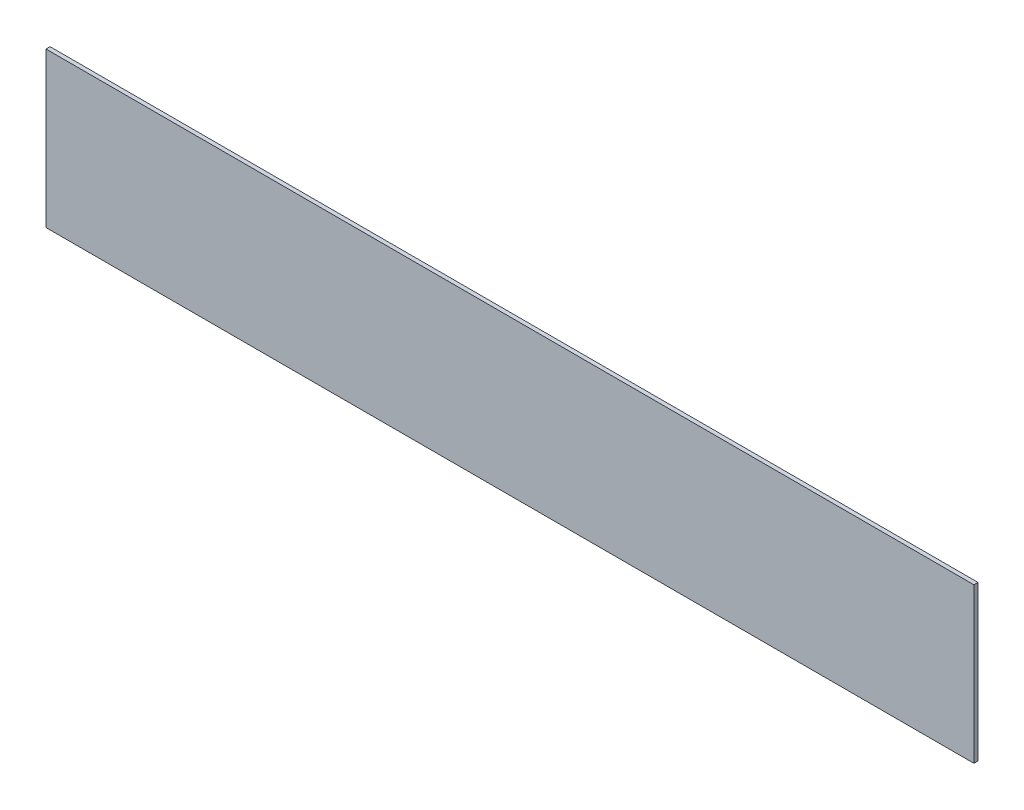
ISO-10303-21;
HEADER;
FILE_DESCRIPTION(('STEP AP214'),'2;1');
FILE_NAME('part.step','',(''),(''),'','','');
FILE_SCHEMA(('AUTOMOTIVE_DESIGN { 1 0 10303 214 1 1 1 1 }'));
ENDSEC;
DATA;
#1=APPLICATION_CONTEXT('core data for automotive mechanical design processes');
#2=APPLICATION_PROTOCOL_DEFINITION('international standard','automotive_design',2000,#1);
#3=PRODUCT_CONTEXT('',#1,'mechanical');
#4=PRODUCT('Part','Part','',(#3));
#5=PRODUCT_RELATED_PRODUCT_CATEGORY('part','',(#4));
#6=PRODUCT_DEFINITION_FORMATION('','',#4);
#7=PRODUCT_DEFINITION_CONTEXT('part definition',#1,'design');
#8=PRODUCT_DEFINITION('design','',#6,#7);
#9=PRODUCT_DEFINITION_SHAPE('','',#8);
#10=(LENGTH_UNIT() NAMED_UNIT(*) SI_UNIT(.MILLI.,.METRE.));
#11=(NAMED_UNIT(*) PLANE_ANGLE_UNIT() SI_UNIT($,.RADIAN.));
#12=(NAMED_UNIT(*) SI_UNIT($,.STERADIAN.) SOLID_ANGLE_UNIT());
#13=UNCERTAINTY_MEASURE_WITH_UNIT(LENGTH_MEASURE(1.E-05),#10,'distance_accuracy_value','');
#14=(GEOMETRIC_REPRESENTATION_CONTEXT(3) GLOBAL_UNCERTAINTY_ASSIGNED_CONTEXT((#13)) GLOBAL_UNIT_ASSIGNED_CONTEXT((#10,
#11,#12)) REPRESENTATION_CONTEXT('',''));
#15=CARTESIAN_POINT('',(0.,0.,0.));
#16=DIRECTION('',(0.,0.,1.));
#17=DIRECTION('',(1.,0.,0.));
#18=AXIS2_PLACEMENT_3D('',#15,#16,#17);
#19=CARTESIAN_POINT('',(228.6,38.1,2.));
#20=DIRECTION('',(-1.,0.,0.));
#21=DIRECTION('',(0.,0.,1.));
#22=AXIS2_PLACEMENT_3D('',#19,#20,#21);
#23=PLANE('',#22);
#24=DIRECTION('',(0.,1.,0.));
#25=VECTOR('',#24,1.);
#26=CARTESIAN_POINT('',(228.6,38.1,0.));
#27=LINE('',#26,#25);
#28=CARTESIAN_POINT('',(228.6,-38.1,0.));
#29=VERTEX_POINT('',#28);
#30=CARTESIAN_POINT('',(228.6,38.1,0.));
#31=VERTEX_POINT('',#30);
#32=EDGE_CURVE('E98',#29,#31,#27,.T.);
#33=ORIENTED_EDGE('',*,*,#32,.T.);
#34=DIRECTION('',(0.,0.,-1.));
#35=VECTOR('',#34,1.);
#36=CARTESIAN_POINT('',(228.6,38.1,2.));
#37=LINE('',#36,#35);
#38=CARTESIAN_POINT('',(228.6,38.1,2.));
#39=VERTEX_POINT('',#38);
#40=EDGE_CURVE('E11',#39,#31,#37,.T.);
#41=ORIENTED_EDGE('',*,*,#40,.F.);
#42=DIRECTION('',(0.,1.,0.));
#43=VECTOR('',#42,1.);
#44=CARTESIAN_POINT('',(228.6,38.1,2.));
#45=LINE('',#44,#43);
#46=CARTESIAN_POINT('',(228.6,-38.1,2.));
#47=VERTEX_POINT('',#46);
#48=EDGE_CURVE('E86',#47,#39,#45,.T.);
#49=ORIENTED_EDGE('',*,*,#48,.F.);
#50=DIRECTION('',(0.,0.,-1.));
#51=VECTOR('',#50,1.);
#52=CARTESIAN_POINT('',(228.6,-38.1,2.));
#53=LINE('',#52,#51);
#54=EDGE_CURVE('E94',#47,#29,#53,.T.);
#55=ORIENTED_EDGE('',*,*,#54,.T.);
#56=EDGE_LOOP('',(#33,#41,#49,#55));
#57=FACE_BOUND('',#56,.T.);
#58=ADVANCED_FACE('F35',(#57),#23,.F.);
#59=CARTESIAN_POINT('',(-228.6,38.1,2.));
#60=DIRECTION('',(0.,-1.,0.));
#61=DIRECTION('',(0.,0.,-1.));
#62=AXIS2_PLACEMENT_3D('',#59,#60,#61);
#63=PLANE('',#62);
#64=DIRECTION('',(-1.,0.,0.));
#65=VECTOR('',#64,1.);
#66=CARTESIAN_POINT('',(-228.6,38.1,0.));
#67=LINE('',#66,#65);
#68=CARTESIAN_POINT('',(-228.6,38.1,0.));
#69=VERTEX_POINT('',#68);
#70=EDGE_CURVE('E90',#31,#69,#67,.T.);
#71=ORIENTED_EDGE('',*,*,#70,.T.);
#72=DIRECTION('',(0.,0.,-1.));
#73=VECTOR('',#72,1.);
#74=CARTESIAN_POINT('',(-228.6,38.1,2.));
#75=LINE('',#74,#73);
#76=CARTESIAN_POINT('',(-228.6,38.1,2.));
#77=VERTEX_POINT('',#76);
#78=EDGE_CURVE('E43',#77,#69,#75,.T.);
#79=ORIENTED_EDGE('',*,*,#78,.F.);
#80=DIRECTION('',(-1.,0.,0.));
#81=VECTOR('',#80,1.);
#82=CARTESIAN_POINT('',(-228.6,38.1,2.));
#83=LINE('',#82,#81);
#84=EDGE_CURVE('E81',#39,#77,#83,.T.);
#85=ORIENTED_EDGE('',*,*,#84,.F.);
#86=ORIENTED_EDGE('',*,*,#40,.T.);
#87=EDGE_LOOP('',(#71,#79,#85,#86));
#88=FACE_BOUND('',#87,.T.);
#89=ADVANCED_FACE('F89',(#88),#63,.F.);
#90=CARTESIAN_POINT('',(-228.6,38.1,2.));
#91=DIRECTION('',(1.,0.,0.));
#92=DIRECTION('',(0.,1.,0.));
#93=AXIS2_PLACEMENT_3D('',#90,#91,#92);
#94=PLANE('',#93);
#95=DIRECTION('',(0.,-1.,0.));
#96=VECTOR('',#95,1.);
#97=CARTESIAN_POINT('',(-228.6,38.1,0.));
#98=LINE('',#97,#96);
#99=CARTESIAN_POINT('',(-228.6,-38.1,0.));
#100=VERTEX_POINT('',#99);
#101=EDGE_CURVE('E68',#69,#100,#98,.T.);
#102=ORIENTED_EDGE('',*,*,#101,.T.);
#103=DIRECTION('',(0.,0.,-1.));
#104=VECTOR('',#103,1.);
#105=CARTESIAN_POINT('',(-228.6,-38.1,2.));
#106=LINE('',#105,#104);
#107=CARTESIAN_POINT('',(-228.6,-38.1,2.));
#108=VERTEX_POINT('',#107);
#109=EDGE_CURVE('E91',#108,#100,#106,.T.);
#110=ORIENTED_EDGE('',*,*,#109,.F.);
#111=DIRECTION('',(0.,-1.,0.));
#112=VECTOR('',#111,1.);
#113=CARTESIAN_POINT('',(-228.6,38.1,2.));
#114=LINE('',#113,#112);
#115=EDGE_CURVE('E84',#77,#108,#114,.T.);
#116=ORIENTED_EDGE('',*,*,#115,.F.);
#117=ORIENTED_EDGE('',*,*,#78,.T.);
#118=EDGE_LOOP('',(#102,#110,#116,#117));
#119=FACE_BOUND('',#118,.T.);
#120=ADVANCED_FACE('F92',(#119),#94,.F.);
#121=CARTESIAN_POINT('',(-228.6,-38.1,2.));
#122=DIRECTION('',(0.,1.,0.));
#123=DIRECTION('',(0.,0.,1.));
#124=AXIS2_PLACEMENT_3D('',#121,#122,#123);
#125=PLANE('',#124);
#126=DIRECTION('',(1.,0.,0.));
#127=VECTOR('',#126,1.);
#128=CARTESIAN_POINT('',(-228.6,-38.1,0.));
#129=LINE('',#128,#127);
#130=EDGE_CURVE('E74',#100,#29,#129,.T.);
#131=ORIENTED_EDGE('',*,*,#130,.T.);
#132=ORIENTED_EDGE('',*,*,#54,.F.);
#133=DIRECTION('',(1.,0.,0.));
#134=VECTOR('',#133,1.);
#135=CARTESIAN_POINT('',(-228.6,-38.1,2.));
#136=LINE('',#135,#134);
#137=EDGE_CURVE('E51',#108,#47,#136,.T.);
#138=ORIENTED_EDGE('',*,*,#137,.F.);
#139=ORIENTED_EDGE('',*,*,#109,.T.);
#140=EDGE_LOOP('',(#131,#132,#138,#139));
#141=FACE_BOUND('',#140,.T.);
#142=ADVANCED_FACE('F105',(#141),#125,.F.);
#143=CARTESIAN_POINT('',(0.,0.,2.));
#144=DIRECTION('',(0.,0.,1.));
#145=DIRECTION('',(1.,0.,0.));
#146=AXIS2_PLACEMENT_3D('',#143,#144,#145);
#147=PLANE('',#146);
#148=ORIENTED_EDGE('',*,*,#48,.T.);
#149=ORIENTED_EDGE('',*,*,#84,.T.);
#150=ORIENTED_EDGE('',*,*,#115,.T.);
#151=ORIENTED_EDGE('',*,*,#137,.T.);
#152=EDGE_LOOP('',(#148,#149,#150,#151));
#153=FACE_BOUND('',#152,.T.);
#154=ADVANCED_FACE('F82',(#153),#147,.T.);
#155=CARTESIAN_POINT('',(0.,0.,0.));
#156=DIRECTION('',(0.,0.,1.));
#157=DIRECTION('',(1.,0.,0.));
#158=AXIS2_PLACEMENT_3D('',#155,#156,#157);
#159=PLANE('',#158);
#160=ORIENTED_EDGE('',*,*,#32,.F.);
#161=ORIENTED_EDGE('',*,*,#130,.F.);
#162=ORIENTED_EDGE('',*,*,#101,.F.);
#163=ORIENTED_EDGE('',*,*,#70,.F.);
#164=EDGE_LOOP('',(#160,#161,#162,#163));
#165=FACE_BOUND('',#164,.T.);
#166=ADVANCED_FACE('F108',(#165),#159,.F.);
#167=CLOSED_SHELL('',(#58,#89,#120,#142,#154,#166));
#168=MANIFOLD_SOLID_BREP('B2',#167);
#169=ADVANCED_BREP_SHAPE_REPRESENTATION('',(#18,#168),#14);
#170=SHAPE_DEFINITION_REPRESENTATION(#9,#169);
ENDSEC;
END-ISO-10303-21;
